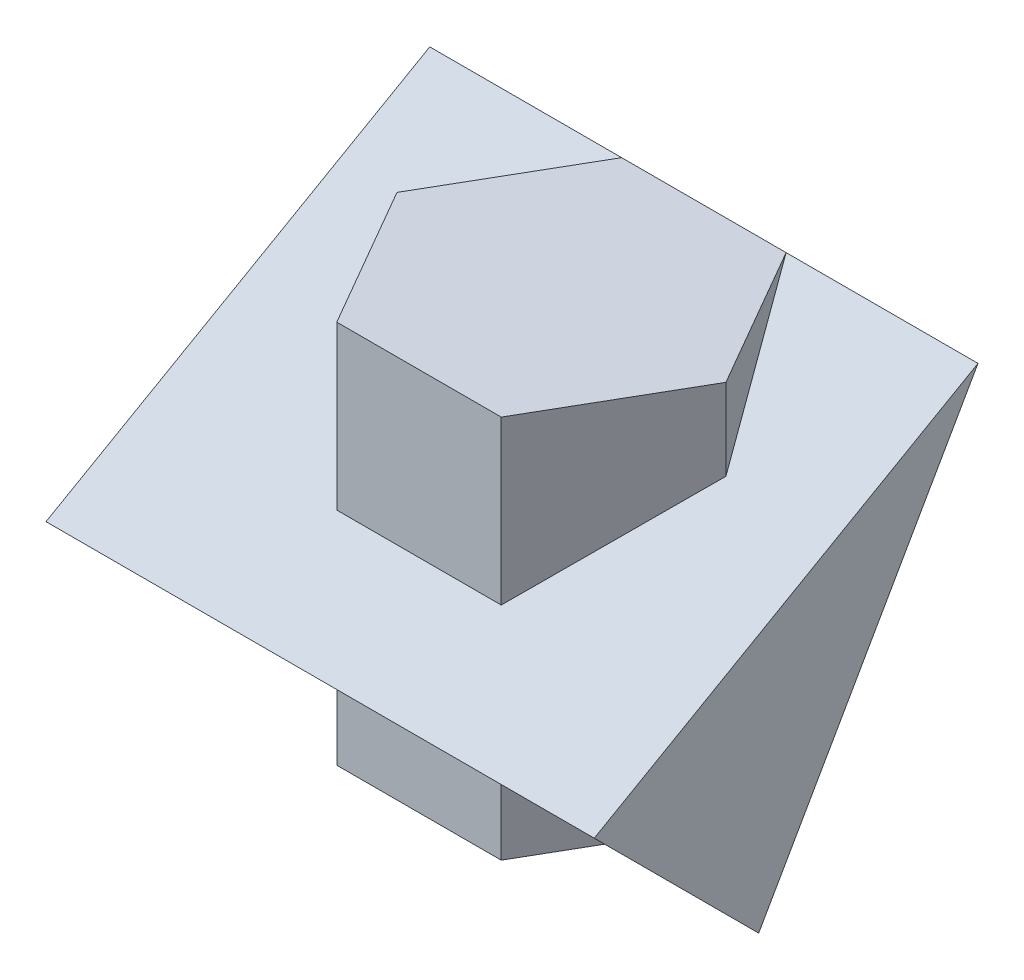
ISO-10303-21;
HEADER;
FILE_DESCRIPTION(('STEP AP214'),'2;1');
FILE_NAME('part.step','',(''),(''),'','','');
FILE_SCHEMA(('AUTOMOTIVE_DESIGN { 1 0 10303 214 1 1 1 1 }'));
ENDSEC;
DATA;
#1=APPLICATION_CONTEXT('core data for automotive mechanical design processes');
#2=APPLICATION_PROTOCOL_DEFINITION('international standard','automotive_design',2000,#1);
#3=PRODUCT_CONTEXT('',#1,'mechanical');
#4=PRODUCT('Part','Part','',(#3));
#5=PRODUCT_RELATED_PRODUCT_CATEGORY('part','',(#4));
#6=PRODUCT_DEFINITION_FORMATION('','',#4);
#7=PRODUCT_DEFINITION_CONTEXT('part definition',#1,'design');
#8=PRODUCT_DEFINITION('design','',#6,#7);
#9=PRODUCT_DEFINITION_SHAPE('','',#8);
#10=(LENGTH_UNIT() NAMED_UNIT(*) SI_UNIT(.MILLI.,.METRE.));
#11=(NAMED_UNIT(*) PLANE_ANGLE_UNIT() SI_UNIT($,.RADIAN.));
#12=(NAMED_UNIT(*) SI_UNIT($,.STERADIAN.) SOLID_ANGLE_UNIT());
#13=UNCERTAINTY_MEASURE_WITH_UNIT(LENGTH_MEASURE(1.E-05),#10,'distance_accuracy_value','');
#14=(GEOMETRIC_REPRESENTATION_CONTEXT(3) GLOBAL_UNCERTAINTY_ASSIGNED_CONTEXT((#13)) GLOBAL_UNIT_ASSIGNED_CONTEXT((#10,
#11,#12)) REPRESENTATION_CONTEXT('',''));
#15=CARTESIAN_POINT('',(0.,0.,0.));
#16=DIRECTION('',(0.,0.,1.));
#17=DIRECTION('',(1.,0.,0.));
#18=AXIS2_PLACEMENT_3D('',#15,#16,#17);
#19=CARTESIAN_POINT('',(-15.,70.,51.9615242270662));
#20=DIRECTION('',(0.,0.,-1.));
#21=DIRECTION('',(-1.,0.,0.));
#22=AXIS2_PLACEMENT_3D('',#19,#20,#21);
#23=PLANE('',#22);
#24=DIRECTION('',(-1.,0.,0.));
#25=VECTOR('',#24,1.);
#26=CARTESIAN_POINT('',(-15.,40.3077004416765,51.9615242270662));
#27=LINE('',#26,#25);
#28=CARTESIAN_POINT('',(15.,40.3077004416765,51.9615242270662));
#29=VERTEX_POINT('',#28);
#30=CARTESIAN_POINT('',(-15.,40.3077004416765,51.9615242270662));
#31=VERTEX_POINT('',#30);
#32=EDGE_CURVE('E54',#29,#31,#27,.T.);
#33=ORIENTED_EDGE('',*,*,#32,.F.);
#34=DIRECTION('',(0.,-1.,0.));
#35=VECTOR('',#34,1.);
#36=CARTESIAN_POINT('',(15.,70.,51.9615242270662));
#37=LINE('',#36,#35);
#38=CARTESIAN_POINT('',(15.,70.,51.9615242270662));
#39=VERTEX_POINT('',#38);
#40=EDGE_CURVE('E11',#39,#29,#37,.T.);
#41=ORIENTED_EDGE('',*,*,#40,.F.);
#42=DIRECTION('',(1.,0.,0.));
#43=VECTOR('',#42,1.);
#44=CARTESIAN_POINT('',(-15.,70.,51.9615242270662));
#45=LINE('',#44,#43);
#46=CARTESIAN_POINT('',(-15.,70.,51.9615242270662));
#47=VERTEX_POINT('',#46);
#48=EDGE_CURVE('E205',#47,#39,#45,.T.);
#49=ORIENTED_EDGE('',*,*,#48,.F.);
#50=DIRECTION('',(0.,-1.,0.));
#51=VECTOR('',#50,1.);
#52=CARTESIAN_POINT('',(-15.,70.,51.9615242270662));
#53=LINE('',#52,#51);
#54=EDGE_CURVE('E236',#47,#31,#53,.T.);
#55=ORIENTED_EDGE('',*,*,#54,.T.);
#56=EDGE_LOOP('',(#33,#41,#49,#55));
#57=FACE_BOUND('',#56,.T.);
#58=ADVANCED_FACE('F32',(#57),#23,.F.);
#59=DIRECTION('',(1.,0.,0.));
#60=VECTOR('',#59,1.);
#61=CARTESIAN_POINT('',(-15.,11.9615242270662,51.9615242270662));
#62=LINE('',#61,#60);
#63=CARTESIAN_POINT('',(-15.,11.9615242270662,51.9615242270662));
#64=VERTEX_POINT('',#63);
#65=CARTESIAN_POINT('',(15.,11.9615242270662,51.9615242270662));
#66=VERTEX_POINT('',#65);
#67=EDGE_CURVE('E189',#64,#66,#62,.T.);
#68=ORIENTED_EDGE('',*,*,#67,.F.);
#69=CARTESIAN_POINT('',(-15.,0.,51.9615242270662));
#70=VERTEX_POINT('',#69);
#71=EDGE_CURVE('E221',#64,#70,#53,.T.);
#72=ORIENTED_EDGE('',*,*,#71,.T.);
#73=DIRECTION('',(1.,0.,0.));
#74=VECTOR('',#73,1.);
#75=CARTESIAN_POINT('',(-15.,0.,51.9615242270662));
#76=LINE('',#75,#74);
#77=CARTESIAN_POINT('',(15.,0.,51.9615242270662));
#78=VERTEX_POINT('',#77);
#79=EDGE_CURVE('E204',#70,#78,#76,.T.);
#80=ORIENTED_EDGE('',*,*,#79,.T.);
#81=EDGE_CURVE('E39',#66,#78,#37,.T.);
#82=ORIENTED_EDGE('',*,*,#81,.F.);
#83=EDGE_LOOP('',(#68,#72,#80,#82));
#84=FACE_BOUND('',#83,.T.);
#85=ADVANCED_FACE('F290',(#84),#23,.F.);
#86=CARTESIAN_POINT('',(15.,70.,51.9615242270662));
#87=DIRECTION('',(-0.866025403784439,0.,-0.5));
#88=DIRECTION('',(-0.5,0.,0.866025403784439));
#89=AXIS2_PLACEMENT_3D('',#86,#87,#88);
#90=PLANE('',#89);
#91=DIRECTION('',(-0.448129079765136,-0.443532762572744,0.776182334502301));
#92=VECTOR('',#91,1.);
#93=CARTESIAN_POINT('',(20.9016393442622,46.1488085515106,41.7395850348565));
#94=LINE('',#93,#92);
#95=CARTESIAN_POINT('',(29.9999999999999,55.1538502208382,25.9807621135331));
#96=VERTEX_POINT('',#95);
#97=EDGE_CURVE('E198',#96,#29,#94,.T.);
#98=ORIENTED_EDGE('',*,*,#97,.F.);
#99=DIRECTION('',(0.,-1.,0.));
#100=VECTOR('',#99,1.);
#101=CARTESIAN_POINT('',(29.9999999999999,70.,25.9807621135331));
#102=LINE('',#101,#100);
#103=CARTESIAN_POINT('',(29.9999999999999,70.,25.9807621135331));
#104=VERTEX_POINT('',#103);
#105=EDGE_CURVE('E248',#104,#96,#102,.T.);
#106=ORIENTED_EDGE('',*,*,#105,.F.);
#107=DIRECTION('',(0.5,0.,-0.866025403784438));
#108=VECTOR('',#107,1.);
#109=CARTESIAN_POINT('',(15.,70.,51.9615242270662));
#110=LINE('',#109,#108);
#111=EDGE_CURVE('E208',#39,#104,#110,.T.);
#112=ORIENTED_EDGE('',*,*,#111,.F.);
#113=ORIENTED_EDGE('',*,*,#40,.T.);
#114=EDGE_LOOP('',(#98,#106,#112,#113));
#115=FACE_BOUND('',#114,.T.);
#116=ADVANCED_FACE('F297',(#115),#90,.F.);
#117=DIRECTION('',(0.377964473009227,-0.654653670707977,-0.654653670707977));
#118=VECTOR('',#117,1.);
#119=CARTESIAN_POINT('',(0.639201595346129,36.8351567011807,76.8351567011807));
#120=LINE('',#119,#118);
#121=CARTESIAN_POINT('',(21.9059892324149,0.,40.));
#122=VERTEX_POINT('',#121);
#123=EDGE_CURVE('E46',#66,#122,#120,.T.);
#124=ORIENTED_EDGE('',*,*,#123,.F.);
#125=ORIENTED_EDGE('',*,*,#81,.T.);
#126=DIRECTION('',(0.5,0.,-0.866025403784438));
#127=VECTOR('',#126,1.);
#128=CARTESIAN_POINT('',(15.,0.,51.9615242270662));
#129=LINE('',#128,#127);
#130=EDGE_CURVE('E225',#78,#122,#129,.T.);
#131=ORIENTED_EDGE('',*,*,#130,.T.);
#132=EDGE_LOOP('',(#124,#125,#131));
#133=FACE_BOUND('',#132,.T.);
#134=ADVANCED_FACE('F295',(#133),#90,.F.);
#135=DIRECTION('',(0.275371356328606,0.834675065193023,-0.476957180110298));
#136=VECTOR('',#135,1.);
#137=CARTESIAN_POINT('',(35.9004739336492,42.4185274244957,15.7608414717168));
#138=LINE('',#137,#136);
#139=CARTESIAN_POINT('',(29.9999999999999,24.5336663013171,25.9807621135331));
#140=VERTEX_POINT('',#139);
#141=EDGE_CURVE('E183',#122,#140,#138,.T.);
#142=ORIENTED_EDGE('',*,*,#141,.F.);
#143=CARTESIAN_POINT('',(29.9999999999999,0.,25.9807621135331));
#144=VERTEX_POINT('',#143);
#145=EDGE_CURVE('E224',#122,#144,#129,.T.);
#146=ORIENTED_EDGE('',*,*,#145,.T.);
#147=EDGE_CURVE('E247',#140,#144,#102,.T.);
#148=ORIENTED_EDGE('',*,*,#147,.F.);
#149=EDGE_LOOP('',(#142,#146,#148));
#150=FACE_BOUND('',#149,.T.);
#151=ADVANCED_FACE('F261',(#150),#90,.F.);
#152=CARTESIAN_POINT('',(29.9999999999999,70.,25.9807621135331));
#153=DIRECTION('',(-0.866025403784439,0.,0.5));
#154=DIRECTION('',(0.5,0.,0.866025403784439));
#155=AXIS2_PLACEMENT_3D('',#152,#153,#154);
#156=PLANE('',#155);
#157=DIRECTION('',(0.448129079765136,-0.443532762572744,0.776182334502302));
#158=VECTOR('',#157,1.);
#159=CARTESIAN_POINT('',(27.0491803278688,58.0744042757553,20.8697925174282));
#160=LINE('',#159,#158);
#161=CARTESIAN_POINT('',(15.,70.,0.));
#162=VERTEX_POINT('',#161);
#163=EDGE_CURVE('E201',#162,#96,#160,.T.);
#164=ORIENTED_EDGE('',*,*,#163,.F.);
#165=DIRECTION('',(-0.5,0.,-0.866025403784439));
#166=VECTOR('',#165,1.);
#167=CARTESIAN_POINT('',(29.9999999999999,70.,25.9807621135331));
#168=LINE('',#167,#166);
#169=EDGE_CURVE('E211',#104,#162,#168,.T.);
#170=ORIENTED_EDGE('',*,*,#169,.F.);
#171=ORIENTED_EDGE('',*,*,#105,.T.);
#172=EDGE_LOOP('',(#164,#170,#171));
#173=FACE_BOUND('',#172,.T.);
#174=ADVANCED_FACE('F302',(#173),#156,.F.);
#175=DIRECTION('',(-0.275371356328605,0.834675065193023,-0.476957180110299));
#176=VECTOR('',#175,1.);
#177=CARTESIAN_POINT('',(19.5497630331753,56.2092637122478,7.88042073585838));
#178=LINE('',#177,#176);
#179=EDGE_CURVE('E180',#140,#162,#178,.T.);
#180=ORIENTED_EDGE('',*,*,#179,.F.);
#181=ORIENTED_EDGE('',*,*,#147,.T.);
#182=DIRECTION('',(-0.5,0.,-0.866025403784439));
#183=VECTOR('',#182,1.);
#184=CARTESIAN_POINT('',(29.9999999999999,0.,25.9807621135331));
#185=LINE('',#184,#183);
#186=CARTESIAN_POINT('',(15.,0.,0.));
#187=VERTEX_POINT('',#186);
#188=EDGE_CURVE('E227',#144,#187,#185,.T.);
#189=ORIENTED_EDGE('',*,*,#188,.T.);
#190=DIRECTION('',(0.,-1.,0.));
#191=VECTOR('',#190,1.);
#192=CARTESIAN_POINT('',(15.,70.,0.));
#193=LINE('',#192,#191);
#194=EDGE_CURVE('E245',#162,#187,#193,.T.);
#195=ORIENTED_EDGE('',*,*,#194,.F.);
#196=EDGE_LOOP('',(#180,#181,#189,#195));
#197=FACE_BOUND('',#196,.T.);
#198=ADVANCED_FACE('F256',(#197),#156,.F.);
#199=CARTESIAN_POINT('',(-15.,70.,0.));
#200=DIRECTION('',(0.866025403784438,0.,0.500000000000001));
#201=DIRECTION('',(0.500000000000001,0.,-0.866025403784438));
#202=AXIS2_PLACEMENT_3D('',#199,#200,#201);
#203=PLANE('',#202);
#204=DIRECTION('',(0.448129079765136,0.443532762572744,-0.776182334502301));
#205=VECTOR('',#204,1.);
#206=CARTESIAN_POINT('',(-15.,70.,0.));
#207=LINE('',#206,#205);
#208=CARTESIAN_POINT('',(-29.9999999999999,55.1538502208383,25.9807621135331));
#209=VERTEX_POINT('',#208);
#210=CARTESIAN_POINT('',(-15.,70.,0.));
#211=VERTEX_POINT('',#210);
#212=EDGE_CURVE('E195',#209,#211,#207,.T.);
#213=ORIENTED_EDGE('',*,*,#212,.F.);
#214=DIRECTION('',(0.,-1.,0.));
#215=VECTOR('',#214,1.);
#216=CARTESIAN_POINT('',(-29.9999999999999,70.,25.9807621135331));
#217=LINE('',#216,#215);
#218=CARTESIAN_POINT('',(-29.9999999999999,70.,25.9807621135331));
#219=VERTEX_POINT('',#218);
#220=EDGE_CURVE('E239',#219,#209,#217,.T.);
#221=ORIENTED_EDGE('',*,*,#220,.F.);
#222=DIRECTION('',(-0.500000000000001,0.,0.866025403784438));
#223=VECTOR('',#222,1.);
#224=CARTESIAN_POINT('',(-15.,70.,0.));
#225=LINE('',#224,#223);
#226=EDGE_CURVE('E217',#211,#219,#225,.T.);
#227=ORIENTED_EDGE('',*,*,#226,.F.);
#228=EDGE_LOOP('',(#213,#221,#227));
#229=FACE_BOUND('',#228,.T.);
#230=ADVANCED_FACE('F341',(#229),#203,.F.);
#231=DIRECTION('',(-0.275371356328606,-0.834675065193022,0.476957180110298));
#232=VECTOR('',#231,1.);
#233=CARTESIAN_POINT('',(-15.,70.,0.));
#234=LINE('',#233,#232);
#235=CARTESIAN_POINT('',(-29.9999999999999,24.5336663013171,25.9807621135331));
#236=VERTEX_POINT('',#235);
#237=EDGE_CURVE('E177',#211,#236,#234,.T.);
#238=ORIENTED_EDGE('',*,*,#237,.F.);
#239=DIRECTION('',(0.,-1.,0.));
#240=VECTOR('',#239,1.);
#241=CARTESIAN_POINT('',(-15.,70.,0.));
#242=LINE('',#241,#240);
#243=CARTESIAN_POINT('',(-15.,0.,0.));
#244=VERTEX_POINT('',#243);
#245=EDGE_CURVE('E242',#211,#244,#242,.T.);
#246=ORIENTED_EDGE('',*,*,#245,.T.);
#247=DIRECTION('',(-0.500000000000001,0.,0.866025403784438));
#248=VECTOR('',#247,1.);
#249=CARTESIAN_POINT('',(-15.,0.,0.));
#250=LINE('',#249,#248);
#251=CARTESIAN_POINT('',(-29.9999999999999,0.,25.9807621135331));
#252=VERTEX_POINT('',#251);
#253=EDGE_CURVE('E231',#244,#252,#250,.T.);
#254=ORIENTED_EDGE('',*,*,#253,.T.);
#255=EDGE_CURVE('E238',#236,#252,#217,.T.);
#256=ORIENTED_EDGE('',*,*,#255,.F.);
#257=EDGE_LOOP('',(#238,#246,#254,#256));
#258=FACE_BOUND('',#257,.T.);
#259=ADVANCED_FACE('F275',(#258),#203,.F.);
#260=CARTESIAN_POINT('',(-29.9999999999999,70.,25.9807621135331));
#261=DIRECTION('',(0.866025403784439,0.,-0.5));
#262=DIRECTION('',(-0.5,0.,-0.866025403784439));
#263=AXIS2_PLACEMENT_3D('',#260,#261,#262);
#264=PLANE('',#263);
#265=DIRECTION('',(-0.448129079765136,0.443532762572744,-0.776182334502302));
#266=VECTOR('',#265,1.);
#267=CARTESIAN_POINT('',(-32.9508196721311,58.0744042757553,20.8697925174282));
#268=LINE('',#267,#266);
#269=EDGE_CURVE('E192',#31,#209,#268,.T.);
#270=ORIENTED_EDGE('',*,*,#269,.F.);
#271=ORIENTED_EDGE('',*,*,#54,.F.);
#272=DIRECTION('',(0.5,0.,0.866025403784439));
#273=VECTOR('',#272,1.);
#274=CARTESIAN_POINT('',(-29.9999999999999,70.,25.9807621135331));
#275=LINE('',#274,#273);
#276=EDGE_CURVE('E219',#219,#47,#275,.T.);
#277=ORIENTED_EDGE('',*,*,#276,.F.);
#278=ORIENTED_EDGE('',*,*,#220,.T.);
#279=EDGE_LOOP('',(#270,#271,#277,#278));
#280=FACE_BOUND('',#279,.T.);
#281=ADVANCED_FACE('F358',(#280),#264,.F.);
#282=DIRECTION('',(0.377964473009227,0.654653670707977,0.654653670707977));
#283=VECTOR('',#282,1.);
#284=CARTESIAN_POINT('',(-9.21063016677472,21.9890069220189,61.9890069220189));
#285=LINE('',#284,#283);
#286=CARTESIAN_POINT('',(-21.9059892324149,0.,40.));
#287=VERTEX_POINT('',#286);
#288=EDGE_CURVE('E186',#287,#64,#285,.T.);
#289=ORIENTED_EDGE('',*,*,#288,.F.);
#290=DIRECTION('',(0.5,0.,0.866025403784439));
#291=VECTOR('',#290,1.);
#292=CARTESIAN_POINT('',(-29.9999999999999,0.,25.9807621135331));
#293=LINE('',#292,#291);
#294=EDGE_CURVE('E234',#287,#70,#293,.T.);
#295=ORIENTED_EDGE('',*,*,#294,.T.);
#296=ORIENTED_EDGE('',*,*,#71,.F.);
#297=EDGE_LOOP('',(#289,#295,#296));
#298=FACE_BOUND('',#297,.T.);
#299=ADVANCED_FACE('F293',(#298),#264,.F.);
#300=DIRECTION('',(0.275371356328605,-0.834675065193023,0.476957180110299));
#301=VECTOR('',#300,1.);
#302=CARTESIAN_POINT('',(-40.4502369668245,56.2092637122479,7.88042073585837));
#303=LINE('',#302,#301);
#304=EDGE_CURVE('E147',#236,#287,#303,.T.);
#305=ORIENTED_EDGE('',*,*,#304,.F.);
#306=ORIENTED_EDGE('',*,*,#255,.T.);
#307=EDGE_CURVE('E209',#252,#287,#293,.T.);
#308=ORIENTED_EDGE('',*,*,#307,.T.);
#309=EDGE_LOOP('',(#305,#306,#308));
#310=FACE_BOUND('',#309,.T.);
#311=ADVANCED_FACE('F368',(#310),#264,.F.);
#312=CARTESIAN_POINT('',(15.,70.,0.));
#313=DIRECTION('',(0.,0.,1.));
#314=DIRECTION('',(1.,0.,0.));
#315=AXIS2_PLACEMENT_3D('',#312,#313,#314);
#316=PLANE('',#315);
#317=DIRECTION('',(-1.,0.,0.));
#318=VECTOR('',#317,1.);
#319=CARTESIAN_POINT('',(15.,0.,0.));
#320=LINE('',#319,#318);
#321=EDGE_CURVE('E229',#187,#244,#320,.T.);
#322=ORIENTED_EDGE('',*,*,#321,.T.);
#323=ORIENTED_EDGE('',*,*,#245,.F.);
#324=DIRECTION('',(-1.,0.,0.));
#325=VECTOR('',#324,1.);
#326=CARTESIAN_POINT('',(15.,70.,0.));
#327=LINE('',#326,#325);
#328=EDGE_CURVE('E214',#162,#211,#327,.T.);
#329=ORIENTED_EDGE('',*,*,#328,.F.);
#330=ORIENTED_EDGE('',*,*,#194,.T.);
#331=EDGE_LOOP('',(#322,#323,#329,#330));
#332=FACE_BOUND('',#331,.T.);
#333=ADVANCED_FACE('F271',(#332),#316,.F.);
#334=CARTESIAN_POINT('',(0.,70.,0.));
#335=DIRECTION('',(0.,1.,0.));
#336=DIRECTION('',(0.,0.,1.));
#337=AXIS2_PLACEMENT_3D('',#334,#335,#336);
#338=PLANE('',#337);
#339=ORIENTED_EDGE('',*,*,#48,.T.);
#340=ORIENTED_EDGE('',*,*,#111,.T.);
#341=ORIENTED_EDGE('',*,*,#169,.T.);
#342=ORIENTED_EDGE('',*,*,#328,.T.);
#343=ORIENTED_EDGE('',*,*,#226,.T.);
#344=ORIENTED_EDGE('',*,*,#276,.T.);
#345=EDGE_LOOP('',(#339,#340,#341,#342,#343,#344));
#346=FACE_BOUND('',#345,.T.);
#347=ADVANCED_FACE('F279',(#346),#338,.T.);
#348=CARTESIAN_POINT('',(0.,0.,0.));
#349=DIRECTION('',(0.,1.,0.));
#350=DIRECTION('',(0.,0.,1.));
#351=AXIS2_PLACEMENT_3D('',#348,#349,#350);
#352=PLANE('',#351);
#353=ORIENTED_EDGE('',*,*,#294,.F.);
#354=ORIENTED_EDGE('',*,*,#307,.F.);
#355=ORIENTED_EDGE('',*,*,#253,.F.);
#356=ORIENTED_EDGE('',*,*,#321,.F.);
#357=ORIENTED_EDGE('',*,*,#188,.F.);
#358=ORIENTED_EDGE('',*,*,#145,.F.);
#359=ORIENTED_EDGE('',*,*,#130,.F.);
#360=ORIENTED_EDGE('',*,*,#79,.F.);
#361=EDGE_LOOP('',(#353,#354,#355,#356,#357,#358,#359,#360));
#362=FACE_BOUND('',#361,.T.);
#363=ADVANCED_FACE('F266',(#362),#352,.F.);
#364=CARTESIAN_POINT('',(50.,30.,70.));
#365=DIRECTION('',(0.,-0.868243142124459,-0.496138938356834));
#366=DIRECTION('',(0.,0.496138938356834,-0.868243142124459));
#367=AXIS2_PLACEMENT_3D('',#364,#365,#366);
#368=PLANE('',#367);
#369=DIRECTION('',(-1.,0.,0.));
#370=VECTOR('',#369,1.);
#371=CARTESIAN_POINT('',(50.,70.,0.));
#372=LINE('',#371,#370);
#373=CARTESIAN_POINT('',(50.,70.,0.));
#374=VERTEX_POINT('',#373);
#375=EDGE_CURVE('E170',#374,#162,#372,.T.);
#376=ORIENTED_EDGE('',*,*,#375,.T.);
#377=ORIENTED_EDGE('',*,*,#163,.T.);
#378=ORIENTED_EDGE('',*,*,#97,.T.);
#379=ORIENTED_EDGE('',*,*,#32,.T.);
#380=ORIENTED_EDGE('',*,*,#269,.T.);
#381=ORIENTED_EDGE('',*,*,#212,.T.);
#382=CARTESIAN_POINT('',(-50.,70.,0.));
#383=VERTEX_POINT('',#382);
#384=EDGE_CURVE('E161',#211,#383,#372,.T.);
#385=ORIENTED_EDGE('',*,*,#384,.T.);
#386=DIRECTION('',(0.,-0.496138938356834,0.868243142124459));
#387=VECTOR('',#386,1.);
#388=CARTESIAN_POINT('',(-50.,30.,70.));
#389=LINE('',#388,#387);
#390=CARTESIAN_POINT('',(-50.,30.,70.));
#391=VERTEX_POINT('',#390);
#392=EDGE_CURVE('E153',#383,#391,#389,.T.);
#393=ORIENTED_EDGE('',*,*,#392,.T.);
#394=DIRECTION('',(-1.,0.,0.));
#395=VECTOR('',#394,1.);
#396=CARTESIAN_POINT('',(50.,30.,70.));
#397=LINE('',#396,#395);
#398=CARTESIAN_POINT('',(50.,30.,70.));
#399=VERTEX_POINT('',#398);
#400=EDGE_CURVE('E134',#399,#391,#397,.T.);
#401=ORIENTED_EDGE('',*,*,#400,.F.);
#402=DIRECTION('',(0.,-0.496138938356834,0.868243142124459));
#403=VECTOR('',#402,1.);
#404=CARTESIAN_POINT('',(50.,30.,70.));
#405=LINE('',#404,#403);
#406=EDGE_CURVE('E165',#374,#399,#405,.T.);
#407=ORIENTED_EDGE('',*,*,#406,.F.);
#408=EDGE_LOOP('',(#376,#377,#378,#379,#380,#381,#385,#393,#401,#407));
#409=FACE_BOUND('',#408,.T.);
#410=ADVANCED_FACE('F158',(#409),#368,.F.);
#411=CARTESIAN_POINT('',(50.,0.,40.));
#412=DIRECTION('',(0.,0.707106781186548,-0.707106781186547));
#413=DIRECTION('',(0.,0.707106781186547,0.707106781186548));
#414=AXIS2_PLACEMENT_3D('',#411,#412,#413);
#415=PLANE('',#414);
#416=ORIENTED_EDGE('',*,*,#67,.T.);
#417=ORIENTED_EDGE('',*,*,#123,.T.);
#418=DIRECTION('',(-1.,0.,0.));
#419=VECTOR('',#418,1.);
#420=CARTESIAN_POINT('',(50.,0.,40.));
#421=LINE('',#420,#419);
#422=CARTESIAN_POINT('',(50.,0.,40.));
#423=VERTEX_POINT('',#422);
#424=EDGE_CURVE('E148',#423,#122,#421,.T.);
#425=ORIENTED_EDGE('',*,*,#424,.F.);
#426=DIRECTION('',(0.,-0.707106781186547,-0.707106781186548));
#427=VECTOR('',#426,1.);
#428=CARTESIAN_POINT('',(50.,0.,40.));
#429=LINE('',#428,#427);
#430=EDGE_CURVE('E142',#399,#423,#429,.T.);
#431=ORIENTED_EDGE('',*,*,#430,.F.);
#432=ORIENTED_EDGE('',*,*,#400,.T.);
#433=DIRECTION('',(0.,-0.707106781186547,-0.707106781186548));
#434=VECTOR('',#433,1.);
#435=CARTESIAN_POINT('',(-50.,0.,40.));
#436=LINE('',#435,#434);
#437=CARTESIAN_POINT('',(-50.,0.,40.));
#438=VERTEX_POINT('',#437);
#439=EDGE_CURVE('E139',#391,#438,#436,.T.);
#440=ORIENTED_EDGE('',*,*,#439,.T.);
#441=EDGE_CURVE('E172',#287,#438,#421,.T.);
#442=ORIENTED_EDGE('',*,*,#441,.F.);
#443=ORIENTED_EDGE('',*,*,#288,.T.);
#444=EDGE_LOOP('',(#416,#417,#425,#431,#432,#440,#442,#443));
#445=FACE_BOUND('',#444,.T.);
#446=ADVANCED_FACE('F137',(#445),#415,.F.);
#447=CARTESIAN_POINT('',(50.,70.,0.));
#448=DIRECTION('',(0.,0.496138938356834,0.868243142124459));
#449=DIRECTION('',(0.,-0.868243142124459,0.496138938356834));
#450=AXIS2_PLACEMENT_3D('',#447,#448,#449);
#451=PLANE('',#450);
#452=ORIENTED_EDGE('',*,*,#424,.T.);
#453=ORIENTED_EDGE('',*,*,#141,.T.);
#454=ORIENTED_EDGE('',*,*,#179,.T.);
#455=ORIENTED_EDGE('',*,*,#375,.F.);
#456=DIRECTION('',(0.,0.868243142124459,-0.496138938356834));
#457=VECTOR('',#456,1.);
#458=CARTESIAN_POINT('',(50.,70.,0.));
#459=LINE('',#458,#457);
#460=EDGE_CURVE('E168',#423,#374,#459,.T.);
#461=ORIENTED_EDGE('',*,*,#460,.F.);
#462=EDGE_LOOP('',(#452,#453,#454,#455,#461));
#463=FACE_BOUND('',#462,.T.);
#464=ADVANCED_FACE('F283',(#463),#451,.F.);
#465=ORIENTED_EDGE('',*,*,#384,.F.);
#466=ORIENTED_EDGE('',*,*,#237,.T.);
#467=ORIENTED_EDGE('',*,*,#304,.T.);
#468=ORIENTED_EDGE('',*,*,#441,.T.);
#469=DIRECTION('',(0.,0.868243142124459,-0.496138938356834));
#470=VECTOR('',#469,1.);
#471=CARTESIAN_POINT('',(-50.,70.,0.));
#472=LINE('',#471,#470);
#473=EDGE_CURVE('E155',#438,#383,#472,.T.);
#474=ORIENTED_EDGE('',*,*,#473,.T.);
#475=EDGE_LOOP('',(#465,#466,#467,#468,#474));
#476=FACE_BOUND('',#475,.T.);
#477=ADVANCED_FACE('F432',(#476),#451,.F.);
#478=CARTESIAN_POINT('',(50.,0.,0.));
#479=DIRECTION('',(1.,0.,0.));
#480=DIRECTION('',(0.,0.,-1.));
#481=AXIS2_PLACEMENT_3D('',#478,#479,#480);
#482=PLANE('',#481);
#483=ORIENTED_EDGE('',*,*,#406,.T.);
#484=ORIENTED_EDGE('',*,*,#430,.T.);
#485=ORIENTED_EDGE('',*,*,#460,.T.);
#486=EDGE_LOOP('',(#483,#484,#485));
#487=FACE_BOUND('',#486,.T.);
#488=ADVANCED_FACE('F286',(#487),#482,.T.);
#489=CARTESIAN_POINT('',(-50.,0.,0.));
#490=DIRECTION('',(1.,0.,0.));
#491=DIRECTION('',(0.,0.,-1.));
#492=AXIS2_PLACEMENT_3D('',#489,#490,#491);
#493=PLANE('',#492);
#494=ORIENTED_EDGE('',*,*,#392,.F.);
#495=ORIENTED_EDGE('',*,*,#473,.F.);
#496=ORIENTED_EDGE('',*,*,#439,.F.);
#497=EDGE_LOOP('',(#494,#495,#496));
#498=FACE_BOUND('',#497,.T.);
#499=ADVANCED_FACE('F152',(#498),#493,.F.);
#500=CLOSED_SHELL('',(#58,#85,#116,#134,#151,#174,#198,#230,#259,#281,#299,#311,#333,#347,#363,
#410,#446,#464,#477,#488,#499));
#501=MANIFOLD_SOLID_BREP('B2',#500);
#502=ADVANCED_BREP_SHAPE_REPRESENTATION('',(#18,#501),#14);
#503=SHAPE_DEFINITION_REPRESENTATION(#9,#502);
ENDSEC;
END-ISO-10303-21;
